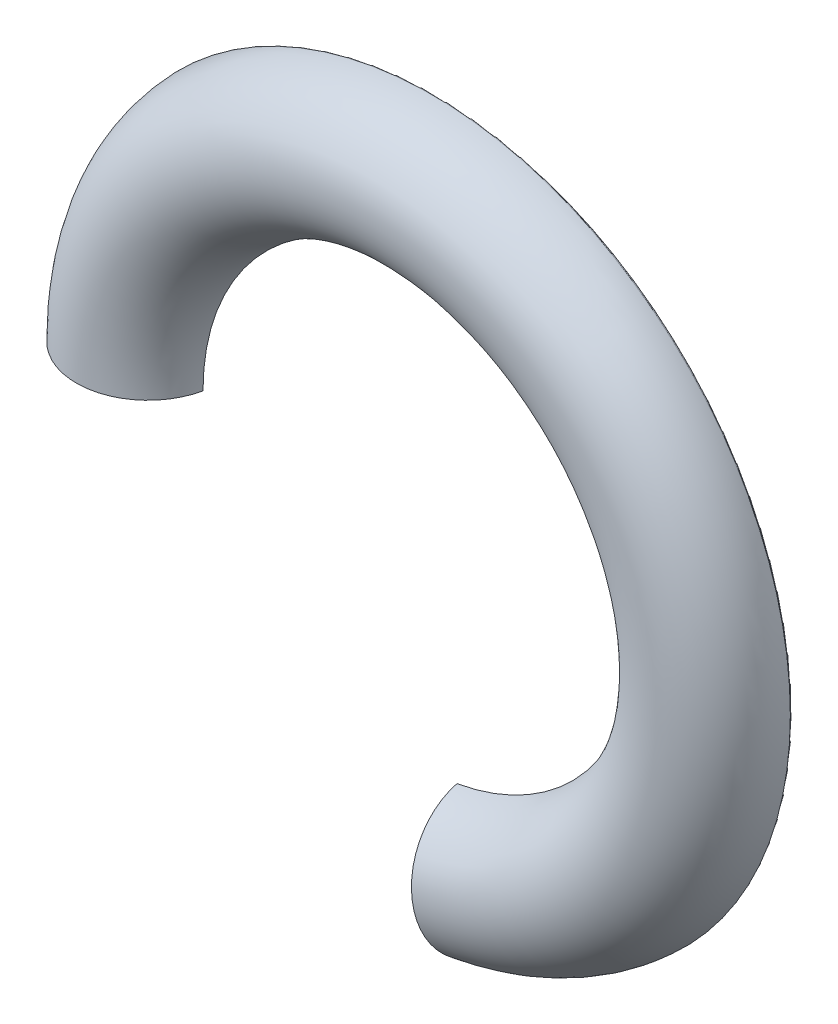
ISO-10303-21;
HEADER;
FILE_DESCRIPTION(('STEP AP214'),'2;1');
FILE_NAME('part.step','',(''),(''),'','','');
FILE_SCHEMA(('AUTOMOTIVE_DESIGN { 1 0 10303 214 1 1 1 1 }'));
ENDSEC;
DATA;
#1=APPLICATION_CONTEXT('core data for automotive mechanical design processes');
#2=APPLICATION_PROTOCOL_DEFINITION('international standard','automotive_design',2000,#1);
#3=PRODUCT_CONTEXT('',#1,'mechanical');
#4=PRODUCT('Part','Part','',(#3));
#5=PRODUCT_RELATED_PRODUCT_CATEGORY('part','',(#4));
#6=PRODUCT_DEFINITION_FORMATION('','',#4);
#7=PRODUCT_DEFINITION_CONTEXT('part definition',#1,'design');
#8=PRODUCT_DEFINITION('design','',#6,#7);
#9=PRODUCT_DEFINITION_SHAPE('','',#8);
#10=(LENGTH_UNIT() NAMED_UNIT(*) SI_UNIT(.MILLI.,.METRE.));
#11=(NAMED_UNIT(*) PLANE_ANGLE_UNIT() SI_UNIT($,.RADIAN.));
#12=(NAMED_UNIT(*) SI_UNIT($,.STERADIAN.) SOLID_ANGLE_UNIT());
#13=UNCERTAINTY_MEASURE_WITH_UNIT(LENGTH_MEASURE(1.E-05),#10,'distance_accuracy_value','');
#14=(GEOMETRIC_REPRESENTATION_CONTEXT(3) GLOBAL_UNCERTAINTY_ASSIGNED_CONTEXT((#13)) GLOBAL_UNIT_ASSIGNED_CONTEXT((#10,
#11,#12)) REPRESENTATION_CONTEXT('',''));
#15=CARTESIAN_POINT('',(0.,0.,0.));
#16=DIRECTION('',(0.,0.,1.));
#17=DIRECTION('',(1.,0.,0.));
#18=AXIS2_PLACEMENT_3D('',#15,#16,#17);
#19=CARTESIAN_POINT('',(0.,0.,0.));
#20=DIRECTION('',(0.,0.,1.));
#21=DIRECTION('',(1.,0.,0.));
#22=AXIS2_PLACEMENT_3D('',#19,#20,#21);
#23=TOROIDAL_SURFACE('',#22,42.,10.5);
#24=CARTESIAN_POINT('',(7.29322346201123,-41.3619256265127,0.));
#25=DIRECTION('',(0.984807753012207,0.173648177666934,0.));
#26=DIRECTION('',(-0.173648177666934,0.984807753012208,0.));
#27=AXIS2_PLACEMENT_3D('',#24,#25,#26);
#28=CIRCLE('',#27,10.5);
#29=CARTESIAN_POINT('',(5.51038852251772,-31.2509662467841,2.2));
#30=VERTEX_POINT('',#29);
#31=CARTESIAN_POINT('',(9.11584490336623,-51.6985254709146,0.287671232876713));
#32=VERTEX_POINT('',#31);
#33=EDGE_CURVE('E166',#30,#32,#28,.T.);
#34=ORIENTED_EDGE('',*,*,#33,.T.);
#35=CARTESIAN_POINT('',(0.,0.,0.287671232876712));
#36=DIRECTION('',(0.,0.,-1.));
#37=DIRECTION('',(-1.,0.,0.));
#38=AXIS2_PLACEMENT_3D('',#35,#36,#37);
#39=CIRCLE('',#38,52.4960585584197);
#40=CARTESIAN_POINT('',(-52.4960585584197,0.,0.287671232876713));
#41=VERTEX_POINT('',#40);
#42=EDGE_CURVE('E11',#32,#41,#39,.F.);
#43=ORIENTED_EDGE('',*,*,#42,.T.);
#44=CARTESIAN_POINT('',(-42.,0.,0.));
#45=DIRECTION('',(0.,1.,0.));
#46=DIRECTION('',(0.,0.,1.));
#47=AXIS2_PLACEMENT_3D('',#44,#45,#46);
#48=CIRCLE('',#47,10.5);
#49=CARTESIAN_POINT('',(-31.7330627741278,0.,2.2));
#50=VERTEX_POINT('',#49);
#51=EDGE_CURVE('E162',#41,#50,#48,.T.);
#52=ORIENTED_EDGE('',*,*,#51,.T.);
#53=CARTESIAN_POINT('',(0.,0.,2.2));
#54=DIRECTION('',(0.,0.,1.));
#55=DIRECTION('',(-1.,0.,0.));
#56=AXIS2_PLACEMENT_3D('',#53,#54,#55);
#57=CIRCLE('',#56,31.7330627741278);
#58=EDGE_CURVE('E150',#30,#50,#57,.T.);
#59=ORIENTED_EDGE('',*,*,#58,.F.);
#60=EDGE_LOOP('',(#34,#43,#52,#59));
#61=FACE_BOUND('',#60,.T.);
#62=ADVANCED_FACE('F34',(#61),#23,.T.);
#63=CARTESIAN_POINT('',(-52.5,0.,0.));
#64=DIRECTION('',(0.,0.,1.));
#65=DIRECTION('',(1.,0.,0.));
#66=AXIS2_PLACEMENT_3D('',#63,#64,#65);
#67=PLANE('',#66);
#68=CARTESIAN_POINT('',(0.,0.,0.));
#69=DIRECTION('',(0.,0.,1.));
#70=DIRECTION('',(1.,0.,0.));
#71=AXIS2_PLACEMENT_3D('',#68,#69,#70);
#72=CIRCLE('',#71,52.18);
#73=CARTESIAN_POINT('',(9.33657762812025,-51.3379072245264,0.));
#74=VERTEX_POINT('',#73);
#75=CARTESIAN_POINT('',(-52.179248748904,0.279999999999994,0.));
#76=VERTEX_POINT('',#75);
#77=EDGE_CURVE('E156',#74,#76,#72,.T.);
#78=ORIENTED_EDGE('',*,*,#77,.T.);
#79=DIRECTION('',(-1.,0.,0.));
#80=VECTOR('',#79,1.);
#81=CARTESIAN_POINT('',(-52.5,0.279999999999994,0.));
#82=LINE('',#81,#80);
#83=CARTESIAN_POINT('',(-52.2154129327385,0.279999999999994,0.));
#84=VERTEX_POINT('',#83);
#85=EDGE_CURVE('E158',#76,#84,#82,.T.);
#86=ORIENTED_EDGE('',*,*,#85,.T.);
#87=CARTESIAN_POINT('',(0.,0.,0.));
#88=DIRECTION('',(0.,0.,1.));
#89=DIRECTION('',(1.,0.,0.));
#90=AXIS2_PLACEMENT_3D('',#87,#88,#89);
#91=CIRCLE('',#90,52.2161636635285);
#92=CARTESIAN_POINT('',(9.34285747273992,-51.373521993148,0.));
#93=VERTEX_POINT('',#92);
#94=EDGE_CURVE('E152',#84,#93,#91,.F.);
#95=ORIENTED_EDGE('',*,*,#94,.T.);
#96=DIRECTION('',(-0.173648177666934,0.984807753012208,0.));
#97=VECTOR('',#96,1.);
#98=CARTESIAN_POINT('',(-1.30732253352654,9.02665025204573,0.));
#99=LINE('',#98,#97);
#100=EDGE_CURVE('E154',#93,#74,#99,.T.);
#101=ORIENTED_EDGE('',*,*,#100,.T.);
#102=EDGE_LOOP('',(#78,#86,#95,#101));
#103=FACE_BOUND('',#102,.T.);
#104=ADVANCED_FACE('F238',(#103),#67,.F.);
#105=CARTESIAN_POINT('',(-31.7330627741278,0.,2.2));
#106=DIRECTION('',(0.,0.,1.));
#107=DIRECTION('',(1.,0.,0.));
#108=AXIS2_PLACEMENT_3D('',#105,#106,#107);
#109=PLANE('',#108);
#110=CARTESIAN_POINT('',(0.,0.,2.2));
#111=DIRECTION('',(0.,0.,1.));
#112=DIRECTION('',(-1.,0.,0.));
#113=AXIS2_PLACEMENT_3D('',#110,#111,#112);
#114=CIRCLE('',#113,33.2730303082914);
#115=CARTESIAN_POINT('',(5.77780107849147,-32.7675382138156,2.2));
#116=VERTEX_POINT('',#115);
#117=CARTESIAN_POINT('',(-33.2730303082914,0.,2.2));
#118=VERTEX_POINT('',#117);
#119=EDGE_CURVE('E141',#116,#118,#114,.T.);
#120=ORIENTED_EDGE('',*,*,#119,.F.);
#121=DIRECTION('',(-0.173648177666934,0.984807753012208,0.));
#122=VECTOR('',#121,1.);
#123=CARTESIAN_POINT('',(-0.956868925171987,5.42667333908493,2.2));
#124=LINE('',#123,#122);
#125=EDGE_CURVE('E342',#116,#30,#124,.T.);
#126=ORIENTED_EDGE('',*,*,#125,.T.);
#127=ORIENTED_EDGE('',*,*,#58,.T.);
#128=DIRECTION('',(-1.,0.,0.));
#129=VECTOR('',#128,1.);
#130=CARTESIAN_POINT('',(-31.7330627741278,0.,2.2));
#131=LINE('',#130,#129);
#132=EDGE_CURVE('E165',#50,#118,#131,.T.);
#133=ORIENTED_EDGE('',*,*,#132,.T.);
#134=EDGE_LOOP('',(#120,#126,#127,#133));
#135=FACE_BOUND('',#134,.T.);
#136=ADVANCED_FACE('F240',(#135),#109,.F.);
#137=CARTESIAN_POINT('',(0.,0.,0.));
#138=DIRECTION('',(0.,0.,1.));
#139=DIRECTION('',(1.,0.,0.));
#140=AXIS2_PLACEMENT_3D('',#137,#138,#139);
#141=TOROIDAL_SURFACE('',#140,42.,9.00000000000001);
#142=CARTESIAN_POINT('',(0.,0.,3.53412993599668));
#143=DIRECTION('',(0.,0.,1.));
#144=DIRECTION('',(-1.,0.,0.));
#145=AXIS2_PLACEMENT_3D('',#142,#143,#144);
#146=CIRCLE('',#145,50.2770722840563);
#147=CARTESIAN_POINT('',(8.73052198055508,-49.5132505840938,3.53412993599668));
#148=VERTEX_POINT('',#147);
#149=CARTESIAN_POINT('',(-50.2770722840563,0.,3.53412993599669));
#150=VERTEX_POINT('',#149);
#151=EDGE_CURVE('E137',#148,#150,#146,.T.);
#152=ORIENTED_EDGE('',*,*,#151,.F.);
#153=CARTESIAN_POINT('',(7.29322346201123,-41.3619256265127,0.));
#154=DIRECTION('',(0.984807753012207,0.173648177666934,0.));
#155=DIRECTION('',(-0.173648177666934,0.984807753012208,0.));
#156=AXIS2_PLACEMENT_3D('',#153,#154,#155);
#157=CIRCLE('',#156,9.00000000000001);
#158=EDGE_CURVE('E120',#148,#116,#157,.F.);
#159=ORIENTED_EDGE('',*,*,#158,.T.);
#160=ORIENTED_EDGE('',*,*,#119,.T.);
#161=CARTESIAN_POINT('',(-42.,0.,0.));
#162=DIRECTION('',(0.,-1.,0.));
#163=DIRECTION('',(0.,0.,1.));
#164=AXIS2_PLACEMENT_3D('',#161,#162,#163);
#165=CIRCLE('',#164,9.00000000000001);
#166=EDGE_CURVE('E176',#118,#150,#165,.T.);
#167=ORIENTED_EDGE('',*,*,#166,.T.);
#168=EDGE_LOOP('',(#152,#159,#160,#167));
#169=FACE_BOUND('',#168,.T.);
#170=ADVANCED_FACE('F181',(#169),#141,.F.);
#171=CARTESIAN_POINT('',(0.,0.,3.53412993599668));
#172=DIRECTION('',(0.,0.,-1.));
#173=DIRECTION('',(-1.,0.,0.));
#174=AXIS2_PLACEMENT_3D('',#171,#172,#173);
#175=CONICAL_SURFACE('',#174,50.2770722840563,0.69813170079773);
#176=CARTESIAN_POINT('',(0.,0.,1.73940868771017));
#177=DIRECTION('',(0.,0.,1.));
#178=DIRECTION('',(-1.,0.,0.));
#179=AXIS2_PLACEMENT_3D('',#176,#177,#178);
#180=CIRCLE('',#179,51.7830222215595);
#181=CARTESIAN_POINT('',(8.99202744286015,-50.9963217581952,1.73940868771017));
#182=VERTEX_POINT('',#181);
#183=CARTESIAN_POINT('',(-51.7830222215595,0.,1.73940868771017));
#184=VERTEX_POINT('',#183);
#185=EDGE_CURVE('E130',#182,#184,#180,.T.);
#186=ORIENTED_EDGE('',*,*,#185,.F.);
#187=DIRECTION('',(0.111618897048952,-0.633022221559488,-0.766044443118979));
#188=VECTOR('',#187,1.);
#189=CARTESIAN_POINT('',(0.,0.,63.4520114556397));
#190=LINE('',#189,#188);
#191=EDGE_CURVE('E114',#182,#148,#190,.F.);
#192=ORIENTED_EDGE('',*,*,#191,.T.);
#193=ORIENTED_EDGE('',*,*,#151,.T.);
#194=DIRECTION('',(-0.642787609686538,0.,-0.766044443118979));
#195=VECTOR('',#194,1.);
#196=CARTESIAN_POINT('',(-51.7830222215595,0.,1.73940868771017));
#197=LINE('',#196,#195);
#198=EDGE_CURVE('E136',#150,#184,#197,.T.);
#199=ORIENTED_EDGE('',*,*,#198,.T.);
#200=EDGE_LOOP('',(#186,#192,#193,#199));
#201=FACE_BOUND('',#200,.T.);
#202=ADVANCED_FACE('F135',(#201),#175,.F.);
#203=CARTESIAN_POINT('',(0.,0.,1.4180148828669));
#204=DIRECTION('',(0.,0.,1.));
#205=DIRECTION('',(1.,0.,0.));
#206=AXIS2_PLACEMENT_3D('',#203,#204,#205);
#207=TOROIDAL_SURFACE('',#206,51.4,0.5);
#208=CARTESIAN_POINT('',(0.,0.,1.4180148828669));
#209=DIRECTION('',(0.,0.,1.));
#210=DIRECTION('',(-1.,0.,0.));
#211=AXIS2_PLACEMENT_3D('',#208,#209,#210);
#212=CIRCLE('',#211,51.9);
#213=CARTESIAN_POINT('',(9.01234042091387,-51.1115223813336,1.4180148828669));
#214=VERTEX_POINT('',#213);
#215=CARTESIAN_POINT('',(-51.9,0.,1.4180148828669));
#216=VERTEX_POINT('',#215);
#217=EDGE_CURVE('E133',#214,#216,#212,.T.);
#218=ORIENTED_EDGE('',*,*,#217,.F.);
#219=CARTESIAN_POINT('',(8.92551633208041,-50.6191185048275,1.4180148828669));
#220=DIRECTION('',(0.984807753012207,0.173648177666934,0.));
#221=DIRECTION('',(-0.173648177666934,0.984807753012208,0.));
#222=AXIS2_PLACEMENT_3D('',#219,#220,#221);
#223=CIRCLE('',#222,0.5);
#224=EDGE_CURVE('E117',#214,#182,#223,.F.);
#225=ORIENTED_EDGE('',*,*,#224,.T.);
#226=ORIENTED_EDGE('',*,*,#185,.T.);
#227=CARTESIAN_POINT('',(-51.4,0.,1.4180148828669));
#228=DIRECTION('',(0.,-1.,0.));
#229=DIRECTION('',(0.,0.,1.));
#230=AXIS2_PLACEMENT_3D('',#227,#228,#229);
#231=CIRCLE('',#230,0.5);
#232=EDGE_CURVE('E145',#184,#216,#231,.T.);
#233=ORIENTED_EDGE('',*,*,#232,.T.);
#234=EDGE_LOOP('',(#218,#225,#226,#233));
#235=FACE_BOUND('',#234,.T.);
#236=ADVANCED_FACE('F128',(#235),#207,.F.);
#237=CARTESIAN_POINT('',(0.,0.,0.));
#238=DIRECTION('',(0.,0.,1.));
#239=DIRECTION('',(1.,0.,0.));
#240=AXIS2_PLACEMENT_3D('',#237,#238,#239);
#241=CYLINDRICAL_SURFACE('',#240,51.9);
#242=DIRECTION('',(0.,0.,-1.));
#243=VECTOR('',#242,1.);
#244=CARTESIAN_POINT('',(-51.9,0.,0.));
#245=LINE('',#244,#243);
#246=CARTESIAN_POINT('',(-51.9,0.,0.28));
#247=VERTEX_POINT('',#246);
#248=EDGE_CURVE('E146',#216,#247,#245,.T.);
#249=ORIENTED_EDGE('',*,*,#248,.T.);
#250=CARTESIAN_POINT('',(0.,0.,0.28));
#251=DIRECTION('',(0.,0.,1.));
#252=DIRECTION('',(1.,0.,0.));
#253=AXIS2_PLACEMENT_3D('',#250,#251,#252);
#254=CIRCLE('',#253,51.9);
#255=CARTESIAN_POINT('',(9.01234042091387,-51.1115223813336,0.28));
#256=VERTEX_POINT('',#255);
#257=EDGE_CURVE('E193',#247,#256,#254,.F.);
#258=ORIENTED_EDGE('',*,*,#257,.T.);
#259=DIRECTION('',(0.,0.,1.));
#260=VECTOR('',#259,1.);
#261=CARTESIAN_POINT('',(9.01234042091387,-51.1115223813336,0.));
#262=LINE('',#261,#260);
#263=EDGE_CURVE('E139',#256,#214,#262,.T.);
#264=ORIENTED_EDGE('',*,*,#263,.T.);
#265=ORIENTED_EDGE('',*,*,#217,.T.);
#266=EDGE_LOOP('',(#249,#258,#264,#265));
#267=FACE_BOUND('',#266,.T.);
#268=ADVANCED_FACE('F191',(#267),#241,.F.);
#269=CARTESIAN_POINT('',(0.,0.,-1.2E-05));
#270=DIRECTION('',(0.984807753012207,0.173648177666934,0.));
#271=DIRECTION('',(-0.173648177666934,0.984807753012208,0.));
#272=AXIS2_PLACEMENT_3D('',#269,#270,#271);
#273=PLANE('',#272);
#274=ORIENTED_EDGE('',*,*,#263,.F.);
#275=DIRECTION('',(-0.173648177666934,0.984807753012208,0.));
#276=VECTOR('',#275,1.);
#277=CARTESIAN_POINT('',(0.,0.,0.28));
#278=LINE('',#277,#276);
#279=CARTESIAN_POINT('',(9.11586315467684,-51.6986289792406,0.28));
#280=VERTEX_POINT('',#279);
#281=EDGE_CURVE('E47',#256,#280,#278,.F.);
#282=ORIENTED_EDGE('',*,*,#281,.T.);
#283=CARTESIAN_POINT('',(9.0672416649301,-51.4228828083972,0.28));
#284=DIRECTION('',(0.984807753012207,0.173648177666934,0.));
#285=DIRECTION('',(-0.173648177666934,0.984807753012208,0.));
#286=AXIS2_PLACEMENT_3D('',#283,#284,#285);
#287=CIRCLE('',#286,0.28);
#288=EDGE_CURVE('E59',#280,#32,#287,.F.);
#289=ORIENTED_EDGE('',*,*,#288,.T.);
#290=ORIENTED_EDGE('',*,*,#33,.F.);
#291=ORIENTED_EDGE('',*,*,#125,.F.);
#292=ORIENTED_EDGE('',*,*,#158,.F.);
#293=ORIENTED_EDGE('',*,*,#191,.F.);
#294=ORIENTED_EDGE('',*,*,#224,.F.);
#295=EDGE_LOOP('',(#274,#282,#289,#290,#291,#292,#293,#294));
#296=FACE_BOUND('',#295,.T.);
#297=ADVANCED_FACE('F116',(#296),#273,.F.);
#298=CARTESIAN_POINT('',(0.,0.,-1.2E-05));
#299=DIRECTION('',(0.,1.,0.));
#300=DIRECTION('',(-1.,0.,0.));
#301=AXIS2_PLACEMENT_3D('',#298,#299,#300);
#302=PLANE('',#301);
#303=CARTESIAN_POINT('',(-52.2161636635285,0.,0.28));
#304=DIRECTION('',(0.,1.,0.));
#305=DIRECTION('',(-1.,0.,0.));
#306=AXIS2_PLACEMENT_3D('',#303,#304,#305);
#307=CIRCLE('',#306,0.28);
#308=CARTESIAN_POINT('',(-52.4961636635285,0.,0.28));
#309=VERTEX_POINT('',#308);
#310=EDGE_CURVE('E161',#41,#309,#307,.F.);
#311=ORIENTED_EDGE('',*,*,#310,.T.);
#312=DIRECTION('',(-1.,0.,0.));
#313=VECTOR('',#312,1.);
#314=CARTESIAN_POINT('',(0.,0.,0.28));
#315=LINE('',#314,#313);
#316=EDGE_CURVE('E189',#309,#247,#315,.F.);
#317=ORIENTED_EDGE('',*,*,#316,.T.);
#318=ORIENTED_EDGE('',*,*,#248,.F.);
#319=ORIENTED_EDGE('',*,*,#232,.F.);
#320=ORIENTED_EDGE('',*,*,#198,.F.);
#321=ORIENTED_EDGE('',*,*,#166,.F.);
#322=ORIENTED_EDGE('',*,*,#132,.F.);
#323=ORIENTED_EDGE('',*,*,#51,.F.);
#324=EDGE_LOOP('',(#311,#317,#318,#319,#320,#321,#322,#323));
#325=FACE_BOUND('',#324,.T.);
#326=ADVANCED_FACE('F185',(#325),#302,.F.);
#327=CARTESIAN_POINT('',(-1.30732253352655,9.02665025204573,0.28));
#328=DIRECTION('',(-0.173648177666934,0.984807753012208,0.));
#329=DIRECTION('',(-0.984807753012208,-0.173648177666934,0.));
#330=AXIS2_PLACEMENT_3D('',#327,#328,#329);
#331=CYLINDRICAL_SURFACE('',#330,0.28);
#332=CARTESIAN_POINT('',(9.11586315467684,-51.6986289792406,0.28));
#333=CARTESIAN_POINT('',(9.11584593227582,-51.6986534900403,0.267432617925609));
#334=CARTESIAN_POINT('',(9.11654826580719,-51.6976505417966,0.254897085009085));
#335=CARTESIAN_POINT('',(9.11924195360118,-51.6938034041993,0.23036204014481));
#336=CARTESIAN_POINT('',(9.1212220766202,-51.690975257568,0.218358822530962));
#337=CARTESIAN_POINT('',(9.1263188515046,-51.6836948525852,0.195161912696895));
#338=CARTESIAN_POINT('',(9.12943238517206,-51.6792470501604,0.183966099466527));
#339=CARTESIAN_POINT('',(9.13660544136355,-51.6689984738863,0.16252062130144));
#340=CARTESIAN_POINT('',(9.14066708729241,-51.6631946630757,0.152273153313852));
#341=CARTESIAN_POINT('',(9.15135822264326,-51.6479149548669,0.128876677368306));
#342=CARTESIAN_POINT('',(9.15835977382579,-51.6379062599248,0.116246013380615));
#343=CARTESIAN_POINT('',(9.17342666054435,-51.6163615690652,0.0931057110414849));
#344=CARTESIAN_POINT('',(9.18149401342852,-51.6048226766312,0.0826001930703015));
#345=CARTESIAN_POINT('',(9.20163961956203,-51.5759983194698,0.0599429848324687));
#346=CARTESIAN_POINT('',(9.21406136358046,-51.558217795948,0.0487290441649527));
#347=CARTESIAN_POINT('',(9.23975042688166,-51.5214277443293,0.029891298399211));
#348=CARTESIAN_POINT('',(9.25301872491918,-51.5024167932776,0.0222717376191955));
#349=CARTESIAN_POINT('',(9.27868994183453,-51.4656155791005,0.0109573897377998));
#350=CARTESIAN_POINT('',(9.29104987692648,-51.4478887927181,0.00695064669538487));
#351=CARTESIAN_POINT('',(9.31592565113178,-51.4121945606942,0.00154454657979963));
#352=CARTESIAN_POINT('',(9.32844112543886,-51.3942276726773,0.000139945902564953));
#353=CARTESIAN_POINT('',(9.34158267892186,-51.3753529945155,3.31969367378954E-06));
#354=CARTESIAN_POINT('',(9.34222009732856,-51.3744374741193,4.98510612982661E-09));
#355=CARTESIAN_POINT('',(9.34285747273991,-51.373521993148,0.));
#356=B_SPLINE_CURVE_WITH_KNOTS('',3,(#332,#333,#334,#335,#336,#337,#338,#339,#340,#341,#342,
#343,#344,#345,#346,#347,#348,#349,#350,#351,#352,#353,#354,#355),.UNSPECIFIED.,.F.,.F.,(4,2,2,
2,2,2,2,2,2,2,2,4),(0.,0.0375921325710524,0.0748582650761728,0.112022637767452,0.14927105668436,
0.201691816844412,0.254213259883575,0.327071976188038,0.400016511540679,0.465797280127456,
0.5314453484136,0.534792027360193),.UNSPECIFIED.);
#357=EDGE_CURVE('E200',#280,#93,#356,.T.);
#358=ORIENTED_EDGE('',*,*,#357,.F.);
#359=ORIENTED_EDGE('',*,*,#281,.F.);
#360=CARTESIAN_POINT('',(9.01234042091387,-51.1115223813336,0.28));
#361=CARTESIAN_POINT('',(9.01231582650915,-51.1115050997,0.267426718069894));
#362=CARTESIAN_POINT('',(9.0133197778681,-51.1122081363659,0.25488547588052));
#363=CARTESIAN_POINT('',(9.01717020506924,-51.1149041260908,0.230339891494753));
#364=CARTESIAN_POINT('',(9.02000057258725,-51.1168858020037,0.218331827108637));
#365=CARTESIAN_POINT('',(9.02728578729517,-51.1219859317806,0.195125946632144));
#366=CARTESIAN_POINT('',(9.03173614700876,-51.1251012453918,0.183925993735996));
#367=CARTESIAN_POINT('',(9.04198962807841,-51.1322776990085,0.162472019387746));
#368=CARTESIAN_POINT('',(9.04779580076006,-51.1363409724264,0.152220205522136));
#369=CARTESIAN_POINT('',(9.06308829944783,-51.1470409709835,0.128800917168906));
#370=CARTESIAN_POINT('',(9.07310905024078,-51.1540508834017,0.116153286139132));
#371=CARTESIAN_POINT('',(9.09467984073149,-51.1691358237172,0.092981275239082));
#372=CARTESIAN_POINT('',(9.10623278779327,-51.1772128764147,0.0824610303922027));
#373=CARTESIAN_POINT('',(9.1350641709428,-51.1973630268202,0.0597954789176896));
#374=CARTESIAN_POINT('',(9.15283504383515,-51.2097777728186,0.0485827443714393));
#375=CARTESIAN_POINT('',(9.18960656126953,-51.2354533236036,0.0297486387766289));
#376=CARTESIAN_POINT('',(9.20860858950568,-51.2487150800976,0.0221313912045474));
#377=CARTESIAN_POINT('',(9.24525285147033,-51.2742762023558,0.0108754405368873));
#378=CARTESIAN_POINT('',(9.2628269901656,-51.2865294548563,0.00690173273634424));
#379=CARTESIAN_POINT('',(9.29821402313046,-51.3111907593173,0.00153678500618012));
#380=CARTESIAN_POINT('',(9.31602636050356,-51.3235984466714,0.000140320685584362));
#381=CARTESIAN_POINT('',(9.33474662440993,-51.336632434201,3.35526536961007E-06));
#382=CARTESIAN_POINT('',(9.33566214615038,-51.3372698509459,4.78664273835389E-09));
#383=CARTESIAN_POINT('',(9.33657762812024,-51.3379072245264,0.));
#384=B_SPLINE_CURVE_WITH_KNOTS('',3,(#360,#361,#362,#363,#364,#365,#366,#367,#368,#369,#370,
#371,#372,#373,#374,#375,#376,#377,#378,#379,#380,#381,#382,#383),.UNSPECIFIED.,.F.,.F.,(4,2,2,
2,2,2,2,2,2,2,2,4),(0.,0.0376094389395313,0.0748916277958212,0.112071318990009,
0.149335505428353,0.201823119157516,0.254411793233117,0.327237826367452,0.400147178164131,
0.465363051842867,0.53044657906402,0.533793258363207),.UNSPECIFIED.);
#385=EDGE_CURVE('E39',#74,#256,#384,.F.);
#386=ORIENTED_EDGE('',*,*,#385,.F.);
#387=ORIENTED_EDGE('',*,*,#100,.F.);
#388=EDGE_LOOP('',(#358,#359,#386,#387));
#389=FACE_BOUND('',#388,.T.);
#390=ADVANCED_FACE('F36',(#389),#331,.T.);
#391=CARTESIAN_POINT('',(0.,0.,0.28));
#392=DIRECTION('',(0.,0.,1.));
#393=DIRECTION('',(1.,0.,0.));
#394=AXIS2_PLACEMENT_3D('',#391,#392,#393);
#395=TOROIDAL_SURFACE('',#394,52.18,0.28);
#396=ORIENTED_EDGE('',*,*,#385,.T.);
#397=ORIENTED_EDGE('',*,*,#257,.F.);
#398=CARTESIAN_POINT('',(-51.9,0.,0.28));
#399=CARTESIAN_POINT('',(-51.8999787101397,-2.12198362863701E-05,0.267426718069893));
#400=CARTESIAN_POINT('',(-51.9008454004229,0.000845398209794845,0.254885475880521));
#401=CARTESIAN_POINT('',(-51.9041690516727,0.00416917506715419,0.230339891494755));
#402=CARTESIAN_POINT('',(-51.9066121096373,0.00661242853175774,0.218331827108639));
#403=CARTESIAN_POINT('',(-51.912899821241,0.0129013362168403,0.195125946632146));
#404=CARTESIAN_POINT('',(-51.9167406030925,0.0167431164350375,0.183925993735999));
#405=CARTESIAN_POINT('',(-51.9255885285559,0.0255946459951432,0.162472019387747));
#406=CARTESIAN_POINT('',(-51.9305983030258,0.0306070298429775,0.152220205522136));
#407=CARTESIAN_POINT('',(-51.9437912590912,0.0438091658631443,0.128800917168907));
#408=CARTESIAN_POINT('',(-51.9524347603026,0.0524604204180186,0.116153286139139));
#409=CARTESIAN_POINT('',(-51.9710362549386,0.0710840297358688,0.0929812752390897));
#410=CARTESIAN_POINT('',(-51.9809967472605,0.0810588960906068,0.0824610303922069));
#411=CARTESIAN_POINT('',(-52.0058472887478,0.105953228848702,0.0597954789176901));
#412=CARTESIAN_POINT('',(-52.021159306552,0.121298324232055,0.0485827443714424));
#413=CARTESIAN_POINT('',(-52.0528300950205,0.153052687087044,0.0297486387766343));
#414=CARTESIAN_POINT('',(-52.0691900432094,0.169463151969137,0.0221313912045519));
#415=CARTESIAN_POINT('',(-52.1007260438972,0.201112062956057,0.0108754405368882));
#416=CARTESIAN_POINT('',(-52.1158448591178,0.216291456028465,0.00690173273634373));
#417=CARTESIAN_POINT('',(-52.1462763967377,0.24685848986986,0.00153678500617912));
#418=CARTESIAN_POINT('',(-52.1615886633658,0.26224564551609,0.000140320685583421));
#419=CARTESIAN_POINT('',(-52.1776753750505,0.278418178367213,3.35526536953153E-06));
#420=CARTESIAN_POINT('',(-52.1784620866845,0.279209105019096,4.78664270345011E-09));
#421=CARTESIAN_POINT('',(-52.179248748904,0.279999999999994,0.));
#422=B_SPLINE_CURVE_WITH_KNOTS('',3,(#398,#399,#400,#401,#402,#403,#404,#405,#406,#407,#408,
#409,#410,#411,#412,#413,#414,#415,#416,#417,#418,#419,#420,#421),.UNSPECIFIED.,.F.,.F.,(4,2,2,
2,2,2,2,2,2,2,2,4),(0.,0.0376094389395292,0.0748916277958201,0.112071318990004,
0.149335505428349,0.201823119157509,0.254411793233106,0.327237826367446,0.400147178164114,
0.465363051842879,0.530446579064041,0.533793258363224),.UNSPECIFIED.);
#423=EDGE_CURVE('E205',#76,#247,#422,.F.);
#424=ORIENTED_EDGE('',*,*,#423,.F.);
#425=ORIENTED_EDGE('',*,*,#77,.F.);
#426=EDGE_LOOP('',(#396,#397,#424,#425));
#427=FACE_BOUND('',#426,.T.);
#428=ADVANCED_FACE('F203',(#427),#395,.T.);
#429=CARTESIAN_POINT('',(0.,0.,0.28));
#430=DIRECTION('',(0.,0.,1.));
#431=DIRECTION('',(1.,0.,0.));
#432=AXIS2_PLACEMENT_3D('',#429,#430,#431);
#433=TOROIDAL_SURFACE('',#432,52.2161636635285,0.28);
#434=ORIENTED_EDGE('',*,*,#357,.T.);
#435=ORIENTED_EDGE('',*,*,#94,.F.);
#436=CARTESIAN_POINT('',(-52.4961636635285,0.,0.28));
#437=CARTESIAN_POINT('',(-52.4961848113155,-2.12170097574504E-05,0.267432617925608));
#438=CARTESIAN_POINT('',(-52.4953190590471,0.000844606631950222,0.254897085009084));
#439=CARTESIAN_POINT('',(-52.491998122091,0.00416541968865484,0.230362040144808));
#440=CARTESIAN_POINT('',(-52.4895567861157,0.00660656269841376,0.21835882253096));
#441=CARTESIAN_POINT('',(-52.4832720325142,0.0128901351778705,0.195161912696892));
#442=CARTESIAN_POINT('',(-52.4794324616499,0.0167287200585327,0.183966099466524));
#443=CARTESIAN_POINT('',(-52.4705851724137,0.02557244800239,0.162520621301435));
#444=CARTESIAN_POINT('',(-52.4655748319443,0.030580209573903,0.152273153313846));
#445=CARTESIAN_POINT('',(-52.4523837530074,0.043762216041675,0.128876677368298));
#446=CARTESIAN_POINT('',(-52.4437429192345,0.0523953895668629,0.11624601338061));
#447=CARTESIAN_POINT('',(-52.4251418780615,0.0709745727272234,0.093105711041482));
#448=CARTESIAN_POINT('',(-52.4151791684583,0.0809230720372838,0.0826001930702985));
#449=CARTESIAN_POINT('',(-52.3902909658432,0.105767918240203,0.059942984832465));
#450=CARTESIAN_POINT('',(-52.3749375816386,0.121088503563024,0.0487290441649485));
#451=CARTESIAN_POINT('',(-52.343167312599,0.152775817689517,0.0298912983992071));
#452=CARTESIAN_POINT('',(-52.3267491963861,0.169143757471971,0.0222717376191922));
#453=CARTESIAN_POINT('',(-52.2949648353801,0.200815434697267,0.0109573897377985));
#454=CARTESIAN_POINT('',(-52.2796536389196,0.216065818753739,0.00695064669538454));
#455=CARTESIAN_POINT('',(-52.2488213153434,0.246761912397448,0.00154454657979981));
#456=CARTESIAN_POINT('',(-52.2333006740328,0.262207165890113,0.00013994590256499));
#457=CARTESIAN_POINT('',(-52.2169947514575,0.278426623113719,3.31969367381245E-06));
#458=CARTESIAN_POINT('',(-52.2162038264181,0.27921333615096,4.98510615136684E-09));
#459=CARTESIAN_POINT('',(-52.2154129327385,0.279999999999994,0.));
#460=B_SPLINE_CURVE_WITH_KNOTS('',3,(#436,#437,#438,#439,#440,#441,#442,#443,#444,#445,#446,
#447,#448,#449,#450,#451,#452,#453,#454,#455,#456,#457,#458,#459),.UNSPECIFIED.,.F.,.F.,(4,2,2,
2,2,2,2,2,2,2,2,4),(0.,0.0375921325710541,0.0748582650761759,0.112022637767459,
0.149271056684364,0.201691816844422,0.254213259883586,0.327071976188047,0.400016511540683,
0.465797280127453,0.531445348413598,0.534792027360181),.UNSPECIFIED.);
#461=EDGE_CURVE('E208',#309,#84,#460,.T.);
#462=ORIENTED_EDGE('',*,*,#461,.F.);
#463=ORIENTED_EDGE('',*,*,#310,.F.);
#464=ORIENTED_EDGE('',*,*,#42,.F.);
#465=ORIENTED_EDGE('',*,*,#288,.F.);
#466=EDGE_LOOP('',(#434,#435,#462,#463,#464,#465));
#467=FACE_BOUND('',#466,.T.);
#468=ADVANCED_FACE('F219',(#467),#433,.T.);
#469=CARTESIAN_POINT('',(-52.5,0.279999999999994,0.28));
#470=DIRECTION('',(-1.,0.,0.));
#471=DIRECTION('',(0.,-1.,0.));
#472=AXIS2_PLACEMENT_3D('',#469,#470,#471);
#473=CYLINDRICAL_SURFACE('',#472,0.28);
#474=ORIENTED_EDGE('',*,*,#423,.T.);
#475=ORIENTED_EDGE('',*,*,#316,.F.);
#476=ORIENTED_EDGE('',*,*,#461,.T.);
#477=ORIENTED_EDGE('',*,*,#85,.F.);
#478=EDGE_LOOP('',(#474,#475,#476,#477));
#479=FACE_BOUND('',#478,.T.);
#480=ADVANCED_FACE('F222',(#479),#473,.T.);
#481=CLOSED_SHELL('',(#62,#104,#136,#170,#202,#236,#268,#297,#326,#390,#428,#468,#480));
#482=MANIFOLD_SOLID_BREP('B2',#481);
#483=ADVANCED_BREP_SHAPE_REPRESENTATION('',(#18,#482),#14);
#484=SHAPE_DEFINITION_REPRESENTATION(#9,#483);
ENDSEC;
END-ISO-10303-21;
